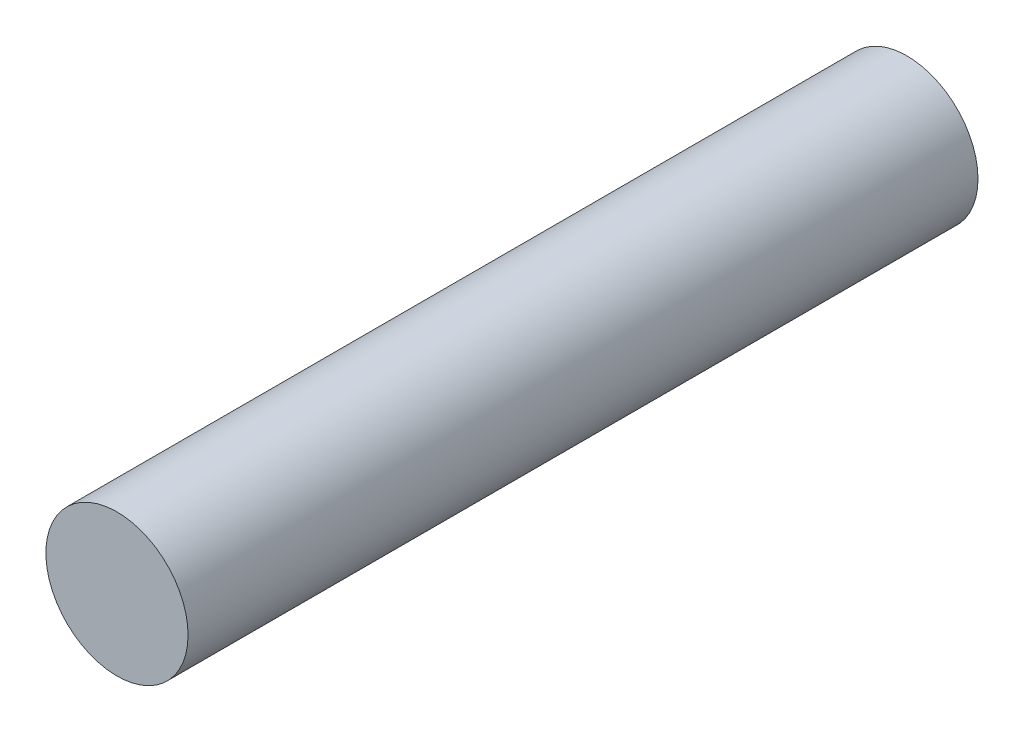
ISO-10303-21;
HEADER;
FILE_DESCRIPTION(('STEP AP214'),'2;1');
FILE_NAME('part.step','',(''),(''),'','','');
FILE_SCHEMA(('AUTOMOTIVE_DESIGN { 1 0 10303 214 1 1 1 1 }'));
ENDSEC;
DATA;
#1=APPLICATION_CONTEXT('core data for automotive mechanical design processes');
#2=APPLICATION_PROTOCOL_DEFINITION('international standard','automotive_design',2000,#1);
#3=PRODUCT_CONTEXT('',#1,'mechanical');
#4=PRODUCT('Part','Part','',(#3));
#5=PRODUCT_RELATED_PRODUCT_CATEGORY('part','',(#4));
#6=PRODUCT_DEFINITION_FORMATION('','',#4);
#7=PRODUCT_DEFINITION_CONTEXT('part definition',#1,'design');
#8=PRODUCT_DEFINITION('design','',#6,#7);
#9=PRODUCT_DEFINITION_SHAPE('','',#8);
#10=(LENGTH_UNIT() NAMED_UNIT(*) SI_UNIT(.MILLI.,.METRE.));
#11=(NAMED_UNIT(*) PLANE_ANGLE_UNIT() SI_UNIT($,.RADIAN.));
#12=(NAMED_UNIT(*) SI_UNIT($,.STERADIAN.) SOLID_ANGLE_UNIT());
#13=UNCERTAINTY_MEASURE_WITH_UNIT(LENGTH_MEASURE(1.E-05),#10,'distance_accuracy_value','');
#14=(GEOMETRIC_REPRESENTATION_CONTEXT(3) GLOBAL_UNCERTAINTY_ASSIGNED_CONTEXT((#13)) GLOBAL_UNIT_ASSIGNED_CONTEXT((#10,
#11,#12)) REPRESENTATION_CONTEXT('',''));
#15=CARTESIAN_POINT('',(0.,0.,0.));
#16=DIRECTION('',(0.,0.,1.));
#17=DIRECTION('',(1.,0.,0.));
#18=AXIS2_PLACEMENT_3D('',#15,#16,#17);
#19=CARTESIAN_POINT('',(0.,0.,15.));
#20=DIRECTION('',(0.,0.,-1.));
#21=DIRECTION('',(-1.,0.,0.));
#22=AXIS2_PLACEMENT_3D('',#19,#20,#21);
#23=CYLINDRICAL_SURFACE('',#22,1.35);
#24=CARTESIAN_POINT('',(0.,0.,15.));
#25=DIRECTION('',(0.,0.,1.));
#26=DIRECTION('',(1.,0.,0.));
#27=AXIS2_PLACEMENT_3D('',#24,#25,#26);
#28=CIRCLE('',#27,1.35);
#29=CARTESIAN_POINT('',(1.35,0.,15.));
#30=VERTEX_POINT('',#29);
#31=EDGE_CURVE('E10',#30,#30,#28,.T.);
#32=ORIENTED_EDGE('',*,*,#31,.F.);
#33=EDGE_LOOP('',(#32));
#34=FACE_BOUND('',#33,.T.);
#35=CARTESIAN_POINT('',(0.,0.,0.));
#36=DIRECTION('',(0.,0.,1.));
#37=DIRECTION('',(1.,0.,0.));
#38=AXIS2_PLACEMENT_3D('',#35,#36,#37);
#39=CIRCLE('',#38,1.35);
#40=CARTESIAN_POINT('',(1.35,0.,0.));
#41=VERTEX_POINT('',#40);
#42=EDGE_CURVE('E36',#41,#41,#39,.T.);
#43=ORIENTED_EDGE('',*,*,#42,.T.);
#44=EDGE_LOOP('',(#43));
#45=FACE_BOUND('',#44,.T.);
#46=ADVANCED_FACE('F33',(#34,#45),#23,.T.);
#47=CARTESIAN_POINT('',(0.,0.,15.));
#48=DIRECTION('',(0.,0.,1.));
#49=DIRECTION('',(1.,0.,0.));
#50=AXIS2_PLACEMENT_3D('',#47,#48,#49);
#51=PLANE('',#50);
#52=ORIENTED_EDGE('',*,*,#31,.T.);
#53=EDGE_LOOP('',(#52));
#54=FACE_BOUND('',#53,.T.);
#55=ADVANCED_FACE('F48',(#54),#51,.T.);
#56=CARTESIAN_POINT('',(0.,0.,0.));
#57=DIRECTION('',(0.,0.,1.));
#58=DIRECTION('',(1.,0.,0.));
#59=AXIS2_PLACEMENT_3D('',#56,#57,#58);
#60=PLANE('',#59);
#61=ORIENTED_EDGE('',*,*,#42,.F.);
#62=EDGE_LOOP('',(#61));
#63=FACE_BOUND('',#62,.T.);
#64=ADVANCED_FACE('F46',(#63),#60,.F.);
#65=CLOSED_SHELL('',(#46,#55,#64));
#66=MANIFOLD_SOLID_BREP('B2',#65);
#67=ADVANCED_BREP_SHAPE_REPRESENTATION('',(#18,#66),#14);
#68=SHAPE_DEFINITION_REPRESENTATION(#9,#67);
ENDSEC;
END-ISO-10303-21;
